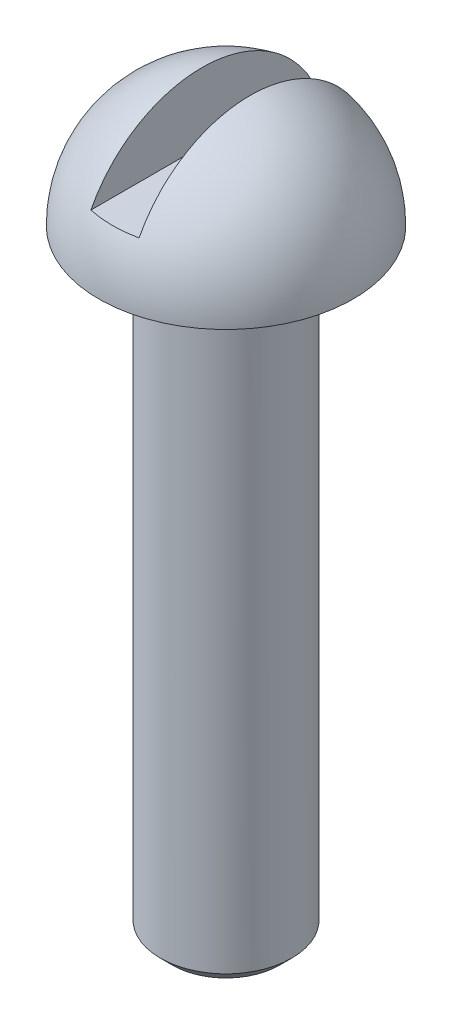
ISO-10303-21;
HEADER;
FILE_DESCRIPTION(('STEP AP214'),'2;1');
FILE_NAME('part.step','',(''),(''),'','','');
FILE_SCHEMA(('AUTOMOTIVE_DESIGN { 1 0 10303 214 1 1 1 1 }'));
ENDSEC;
DATA;
#1=APPLICATION_CONTEXT('core data for automotive mechanical design processes');
#2=APPLICATION_PROTOCOL_DEFINITION('international standard','automotive_design',2000,#1);
#3=PRODUCT_CONTEXT('',#1,'mechanical');
#4=PRODUCT('Part','Part','',(#3));
#5=PRODUCT_RELATED_PRODUCT_CATEGORY('part','',(#4));
#6=PRODUCT_DEFINITION_FORMATION('','',#4);
#7=PRODUCT_DEFINITION_CONTEXT('part definition',#1,'design');
#8=PRODUCT_DEFINITION('design','',#6,#7);
#9=PRODUCT_DEFINITION_SHAPE('','',#8);
#10=(LENGTH_UNIT() NAMED_UNIT(*) SI_UNIT(.MILLI.,.METRE.));
#11=(NAMED_UNIT(*) PLANE_ANGLE_UNIT() SI_UNIT($,.RADIAN.));
#12=(NAMED_UNIT(*) SI_UNIT($,.STERADIAN.) SOLID_ANGLE_UNIT());
#13=UNCERTAINTY_MEASURE_WITH_UNIT(LENGTH_MEASURE(1.E-05),#10,'distance_accuracy_value','');
#14=(GEOMETRIC_REPRESENTATION_CONTEXT(3) GLOBAL_UNCERTAINTY_ASSIGNED_CONTEXT((#13)) GLOBAL_UNIT_ASSIGNED_CONTEXT((#10,
#11,#12)) REPRESENTATION_CONTEXT('',''));
#15=CARTESIAN_POINT('',(0.,0.,0.));
#16=DIRECTION('',(0.,0.,1.));
#17=DIRECTION('',(1.,0.,0.));
#18=AXIS2_PLACEMENT_3D('',#15,#16,#17);
#19=CARTESIAN_POINT('',(0.,0.,0.));
#20=DIRECTION('',(0.,1.,0.));
#21=DIRECTION('',(1.,0.,0.));
#22=AXIS2_PLACEMENT_3D('',#19,#20,#21);
#23=SPHERICAL_SURFACE('',#22,2.9);
#24=CARTESIAN_POINT('',(0.55,0.,0.));
#25=DIRECTION('',(1.,0.,0.));
#26=DIRECTION('',(0.,1.,0.));
#27=AXIS2_PLACEMENT_3D('',#24,#25,#26);
#28=CIRCLE('',#27,2.84736720498077);
#29=CARTESIAN_POINT('',(0.55,1.3,2.53327850817868));
#30=VERTEX_POINT('',#29);
#31=CARTESIAN_POINT('',(0.550000000000132,1.3,-2.53327850817868));
#32=VERTEX_POINT('',#31);
#33=EDGE_CURVE('E13',#30,#32,#28,.F.);
#34=ORIENTED_EDGE('',*,*,#33,.F.);
#35=CARTESIAN_POINT('',(0.,1.3,0.));
#36=DIRECTION('',(0.,-1.,0.));
#37=DIRECTION('',(0.,0.,-1.));
#38=AXIS2_PLACEMENT_3D('',#35,#36,#37);
#39=CIRCLE('',#38,2.59229627936314);
#40=CARTESIAN_POINT('',(-0.55,1.3,2.53327850817868));
#41=VERTEX_POINT('',#40);
#42=EDGE_CURVE('E60',#41,#30,#39,.F.);
#43=ORIENTED_EDGE('',*,*,#42,.F.);
#44=CARTESIAN_POINT('',(-0.55,0.,0.));
#45=DIRECTION('',(-1.,0.,0.));
#46=DIRECTION('',(0.,-1.,0.));
#47=AXIS2_PLACEMENT_3D('',#44,#45,#46);
#48=CIRCLE('',#47,2.84736720498077);
#49=CARTESIAN_POINT('',(-0.549999999999868,1.3,-2.53327850817868));
#50=VERTEX_POINT('',#49);
#51=EDGE_CURVE('E78',#50,#41,#48,.F.);
#52=ORIENTED_EDGE('',*,*,#51,.F.);
#53=EDGE_CURVE('E82',#32,#50,#39,.F.);
#54=ORIENTED_EDGE('',*,*,#53,.F.);
#55=EDGE_LOOP('',(#34,#43,#52,#54));
#56=FACE_BOUND('',#55,.T.);
#57=CARTESIAN_POINT('',(0.,0.,0.));
#58=DIRECTION('',(0.,1.,0.));
#59=DIRECTION('',(-1.,0.,0.));
#60=AXIS2_PLACEMENT_3D('',#57,#58,#59);
#61=CIRCLE('',#60,2.9);
#62=CARTESIAN_POINT('',(-2.9,0.,0.));
#63=VERTEX_POINT('',#62);
#64=EDGE_CURVE('E99',#63,#63,#61,.T.);
#65=ORIENTED_EDGE('',*,*,#64,.T.);
#66=EDGE_LOOP('',(#65));
#67=FACE_BOUND('',#66,.T.);
#68=ADVANCED_FACE('F52',(#56,#67),#23,.T.);
#69=CARTESIAN_POINT('',(0.,-14.,0.));
#70=DIRECTION('',(0.,-1.,0.));
#71=DIRECTION('',(1.,0.,0.));
#72=AXIS2_PLACEMENT_3D('',#69,#70,#71);
#73=PLANE('',#72);
#74=CARTESIAN_POINT('',(0.,-14.,0.));
#75=DIRECTION('',(0.,-1.,0.));
#76=DIRECTION('',(1.,0.,0.));
#77=AXIS2_PLACEMENT_3D('',#74,#75,#76);
#78=CIRCLE('',#77,1.21949999999999);
#79=CARTESIAN_POINT('',(1.2195,-14.,0.));
#80=VERTEX_POINT('',#79);
#81=EDGE_CURVE('E83',#80,#80,#78,.T.);
#82=ORIENTED_EDGE('',*,*,#81,.T.);
#83=EDGE_LOOP('',(#82));
#84=FACE_BOUND('',#83,.T.);
#85=ADVANCED_FACE('F116',(#84),#73,.T.);
#86=CARTESIAN_POINT('',(0.,2.9,0.));
#87=DIRECTION('',(0.,1.,0.));
#88=DIRECTION('',(-1.,0.,0.));
#89=AXIS2_PLACEMENT_3D('',#86,#87,#88);
#90=CYLINDRICAL_SURFACE('',#89,1.5);
#91=CARTESIAN_POINT('',(0.,-13.7195,0.));
#92=DIRECTION('',(0.,-1.,0.));
#93=DIRECTION('',(1.,0.,0.));
#94=AXIS2_PLACEMENT_3D('',#91,#92,#93);
#95=CIRCLE('',#94,1.5);
#96=CARTESIAN_POINT('',(1.5,-13.7195,0.));
#97=VERTEX_POINT('',#96);
#98=EDGE_CURVE('E93',#97,#97,#95,.F.);
#99=ORIENTED_EDGE('',*,*,#98,.T.);
#100=EDGE_LOOP('',(#99));
#101=FACE_BOUND('',#100,.T.);
#102=CARTESIAN_POINT('',(0.,0.,0.));
#103=DIRECTION('',(0.,1.,0.));
#104=DIRECTION('',(-1.,0.,0.));
#105=AXIS2_PLACEMENT_3D('',#102,#103,#104);
#106=CIRCLE('',#105,1.5);
#107=CARTESIAN_POINT('',(-1.5,0.,0.));
#108=VERTEX_POINT('',#107);
#109=EDGE_CURVE('E96',#108,#108,#106,.T.);
#110=ORIENTED_EDGE('',*,*,#109,.F.);
#111=EDGE_LOOP('',(#110));
#112=FACE_BOUND('',#111,.T.);
#113=ADVANCED_FACE('F120',(#101,#112),#90,.T.);
#114=CARTESIAN_POINT('',(0.,0.,0.));
#115=DIRECTION('',(0.,-1.,0.));
#116=DIRECTION('',(1.,0.,0.));
#117=AXIS2_PLACEMENT_3D('',#114,#115,#116);
#118=PLANE('',#117);
#119=ORIENTED_EDGE('',*,*,#109,.T.);
#120=EDGE_LOOP('',(#119));
#121=FACE_BOUND('',#120,.T.);
#122=ORIENTED_EDGE('',*,*,#64,.F.);
#123=EDGE_LOOP('',(#122));
#124=FACE_BOUND('',#123,.T.);
#125=ADVANCED_FACE('F111',(#121,#124),#118,.T.);
#126=CARTESIAN_POINT('',(0.,-13.7195,0.));
#127=DIRECTION('',(0.,1.,0.));
#128=DIRECTION('',(-1.,0.,0.));
#129=AXIS2_PLACEMENT_3D('',#126,#127,#128);
#130=CONICAL_SURFACE('',#129,1.5,0.785398163397456);
#131=ORIENTED_EDGE('',*,*,#81,.F.);
#132=EDGE_LOOP('',(#131));
#133=FACE_BOUND('',#132,.T.);
#134=ORIENTED_EDGE('',*,*,#98,.F.);
#135=EDGE_LOOP('',(#134));
#136=FACE_BOUND('',#135,.T.);
#137=ADVANCED_FACE('F54',(#133,#136),#130,.T.);
#138=CARTESIAN_POINT('',(0.550000000000132,1.30000000000003,-2.9));
#139=DIRECTION('',(1.,0.,0.));
#140=DIRECTION('',(0.,1.,0.));
#141=AXIS2_PLACEMENT_3D('',#138,#139,#140);
#142=PLANE('',#141);
#143=ORIENTED_EDGE('',*,*,#33,.T.);
#144=DIRECTION('',(0.,0.,1.));
#145=VECTOR('',#144,1.);
#146=CARTESIAN_POINT('',(0.550000000000132,1.30000000000003,-2.9));
#147=LINE('',#146,#145);
#148=EDGE_CURVE('E86',#32,#30,#147,.T.);
#149=ORIENTED_EDGE('',*,*,#148,.T.);
#150=EDGE_LOOP('',(#143,#149));
#151=FACE_BOUND('',#150,.T.);
#152=ADVANCED_FACE('F103',(#151),#142,.F.);
#153=CARTESIAN_POINT('',(-0.549999999999868,1.3,-2.9));
#154=DIRECTION('',(0.,-1.,0.));
#155=DIRECTION('',(0.,0.,-1.));
#156=AXIS2_PLACEMENT_3D('',#153,#154,#155);
#157=PLANE('',#156);
#158=ORIENTED_EDGE('',*,*,#42,.T.);
#159=ORIENTED_EDGE('',*,*,#148,.F.);
#160=ORIENTED_EDGE('',*,*,#53,.T.);
#161=DIRECTION('',(0.,0.,1.));
#162=VECTOR('',#161,1.);
#163=CARTESIAN_POINT('',(-0.549999999999868,1.3,-2.9));
#164=LINE('',#163,#162);
#165=EDGE_CURVE('E66',#50,#41,#164,.T.);
#166=ORIENTED_EDGE('',*,*,#165,.T.);
#167=EDGE_LOOP('',(#158,#159,#160,#166));
#168=FACE_BOUND('',#167,.T.);
#169=ADVANCED_FACE('F85',(#168),#157,.F.);
#170=CARTESIAN_POINT('',(-0.549999999999868,1.3,-2.9));
#171=DIRECTION('',(-1.,0.,0.));
#172=DIRECTION('',(0.,-1.,0.));
#173=AXIS2_PLACEMENT_3D('',#170,#171,#172);
#174=PLANE('',#173);
#175=ORIENTED_EDGE('',*,*,#51,.T.);
#176=ORIENTED_EDGE('',*,*,#165,.F.);
#177=EDGE_LOOP('',(#175,#176));
#178=FACE_BOUND('',#177,.T.);
#179=ADVANCED_FACE('F79',(#178),#174,.F.);
#180=CLOSED_SHELL('',(#68,#85,#113,#125,#137,#152,#169,#179));
#181=MANIFOLD_SOLID_BREP('B2',#180);
#182=ADVANCED_BREP_SHAPE_REPRESENTATION('',(#18,#181),#14);
#183=SHAPE_DEFINITION_REPRESENTATION(#9,#182);
ENDSEC;
END-ISO-10303-21;
